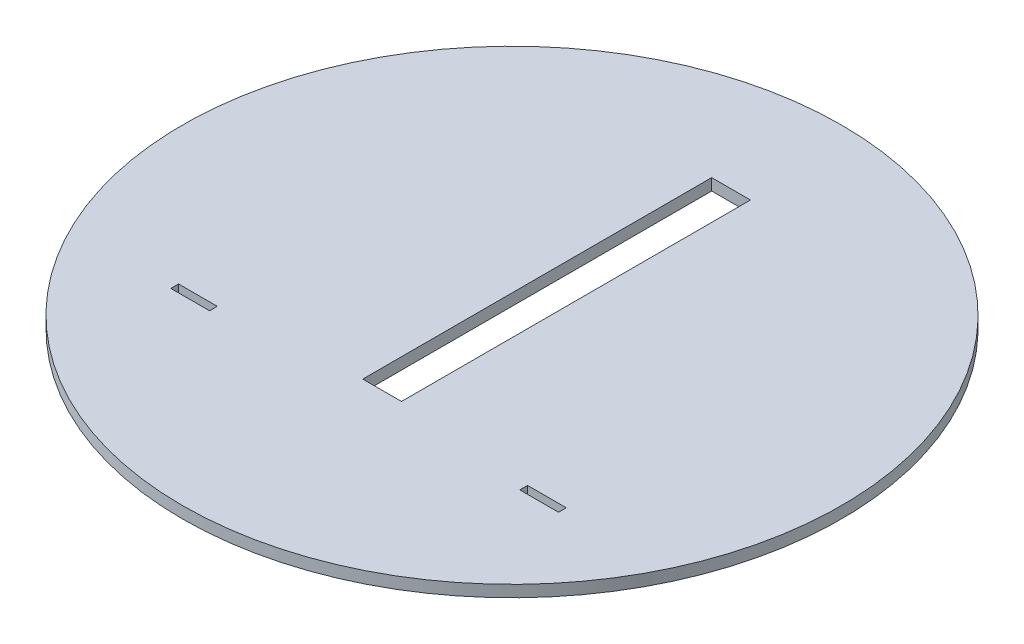
ISO-10303-21;
HEADER;
FILE_DESCRIPTION(('STEP AP214'),'2;1');
FILE_NAME('part.step','',(''),(''),'','','');
FILE_SCHEMA(('AUTOMOTIVE_DESIGN { 1 0 10303 214 1 1 1 1 }'));
ENDSEC;
DATA;
#1=APPLICATION_CONTEXT('core data for automotive mechanical design processes');
#2=APPLICATION_PROTOCOL_DEFINITION('international standard','automotive_design',2000,#1);
#3=PRODUCT_CONTEXT('',#1,'mechanical');
#4=PRODUCT('Part','Part','',(#3));
#5=PRODUCT_RELATED_PRODUCT_CATEGORY('part','',(#4));
#6=PRODUCT_DEFINITION_FORMATION('','',#4);
#7=PRODUCT_DEFINITION_CONTEXT('part definition',#1,'design');
#8=PRODUCT_DEFINITION('design','',#6,#7);
#9=PRODUCT_DEFINITION_SHAPE('','',#8);
#10=(LENGTH_UNIT() NAMED_UNIT(*) SI_UNIT(.MILLI.,.METRE.));
#11=(NAMED_UNIT(*) PLANE_ANGLE_UNIT() SI_UNIT($,.RADIAN.));
#12=(NAMED_UNIT(*) SI_UNIT($,.STERADIAN.) SOLID_ANGLE_UNIT());
#13=UNCERTAINTY_MEASURE_WITH_UNIT(LENGTH_MEASURE(1.E-05),#10,'distance_accuracy_value','');
#14=(GEOMETRIC_REPRESENTATION_CONTEXT(3) GLOBAL_UNCERTAINTY_ASSIGNED_CONTEXT((#13)) GLOBAL_UNIT_ASSIGNED_CONTEXT((#10,
#11,#12)) REPRESENTATION_CONTEXT('',''));
#15=CARTESIAN_POINT('',(0.,0.,0.));
#16=DIRECTION('',(0.,0.,1.));
#17=DIRECTION('',(1.,0.,0.));
#18=AXIS2_PLACEMENT_3D('',#15,#16,#17);
#19=CARTESIAN_POINT('',(0.,0.15,0.));
#20=DIRECTION('',(0.,-1.,0.));
#21=DIRECTION('',(0.,0.,-1.));
#22=AXIS2_PLACEMENT_3D('',#19,#20,#21);
#23=CYLINDRICAL_SURFACE('',#22,8.5);
#24=CARTESIAN_POINT('',(0.,0.15,0.));
#25=DIRECTION('',(0.,1.,0.));
#26=DIRECTION('',(0.,0.,1.));
#27=AXIS2_PLACEMENT_3D('',#24,#25,#26);
#28=CIRCLE('',#27,8.5);
#29=CARTESIAN_POINT('',(0.,0.15,8.5));
#30=VERTEX_POINT('',#29);
#31=EDGE_CURVE('E11',#30,#30,#28,.T.);
#32=ORIENTED_EDGE('',*,*,#31,.F.);
#33=EDGE_LOOP('',(#32));
#34=FACE_BOUND('',#33,.T.);
#35=CARTESIAN_POINT('',(0.,-0.15,0.));
#36=DIRECTION('',(0.,1.,0.));
#37=DIRECTION('',(0.,0.,1.));
#38=AXIS2_PLACEMENT_3D('',#35,#36,#37);
#39=CIRCLE('',#38,8.5);
#40=CARTESIAN_POINT('',(0.,-0.15,8.5));
#41=VERTEX_POINT('',#40);
#42=EDGE_CURVE('E37',#41,#41,#39,.T.);
#43=ORIENTED_EDGE('',*,*,#42,.T.);
#44=EDGE_LOOP('',(#43));
#45=FACE_BOUND('',#44,.T.);
#46=ADVANCED_FACE('F34',(#34,#45),#23,.T.);
#47=CARTESIAN_POINT('',(0.,0.15,0.));
#48=DIRECTION('',(0.,1.,0.));
#49=DIRECTION('',(0.,0.,1.));
#50=AXIS2_PLACEMENT_3D('',#47,#48,#49);
#51=PLANE('',#50);
#52=DIRECTION('',(0.,0.,-1.));
#53=VECTOR('',#52,1.);
#54=CARTESIAN_POINT('',(-4.,0.15,3.8));
#55=LINE('',#54,#53);
#56=CARTESIAN_POINT('',(-4.,0.15,3.8));
#57=VERTEX_POINT('',#56);
#58=CARTESIAN_POINT('',(-4.,0.15,3.6));
#59=VERTEX_POINT('',#58);
#60=EDGE_CURVE('E48',#57,#59,#55,.T.);
#61=ORIENTED_EDGE('',*,*,#60,.F.);
#62=DIRECTION('',(1.,0.,0.));
#63=VECTOR('',#62,1.);
#64=CARTESIAN_POINT('',(-4.,0.15,3.8));
#65=LINE('',#64,#63);
#66=CARTESIAN_POINT('',(-5.,0.15,3.8));
#67=VERTEX_POINT('',#66);
#68=EDGE_CURVE('E130',#67,#57,#65,.T.);
#69=ORIENTED_EDGE('',*,*,#68,.F.);
#70=DIRECTION('',(0.,0.,1.));
#71=VECTOR('',#70,1.);
#72=CARTESIAN_POINT('',(-5.,0.15,3.8));
#73=LINE('',#72,#71);
#74=CARTESIAN_POINT('',(-5.,0.15,3.6));
#75=VERTEX_POINT('',#74);
#76=EDGE_CURVE('E150',#75,#67,#73,.T.);
#77=ORIENTED_EDGE('',*,*,#76,.F.);
#78=DIRECTION('',(-1.,0.,0.));
#79=VECTOR('',#78,1.);
#80=CARTESIAN_POINT('',(-4.,0.15,3.6));
#81=LINE('',#80,#79);
#82=EDGE_CURVE('E144',#59,#75,#81,.T.);
#83=ORIENTED_EDGE('',*,*,#82,.F.);
#84=EDGE_LOOP('',(#61,#69,#77,#83));
#85=FACE_BOUND('',#84,.T.);
#86=DIRECTION('',(0.,0.,-1.));
#87=VECTOR('',#86,1.);
#88=CARTESIAN_POINT('',(5.,0.15,3.8));
#89=LINE('',#88,#87);
#90=CARTESIAN_POINT('',(5.,0.15,3.8));
#91=VERTEX_POINT('',#90);
#92=CARTESIAN_POINT('',(5.,0.15,3.6));
#93=VERTEX_POINT('',#92);
#94=EDGE_CURVE('E166',#91,#93,#89,.T.);
#95=ORIENTED_EDGE('',*,*,#94,.F.);
#96=DIRECTION('',(1.,0.,0.));
#97=VECTOR('',#96,1.);
#98=CARTESIAN_POINT('',(5.,0.15,3.8));
#99=LINE('',#98,#97);
#100=CARTESIAN_POINT('',(4.,0.15,3.8));
#101=VERTEX_POINT('',#100);
#102=EDGE_CURVE('E174',#101,#91,#99,.T.);
#103=ORIENTED_EDGE('',*,*,#102,.F.);
#104=DIRECTION('',(0.,0.,1.));
#105=VECTOR('',#104,1.);
#106=CARTESIAN_POINT('',(4.,0.15,3.8));
#107=LINE('',#106,#105);
#108=CARTESIAN_POINT('',(4.,0.15,3.6));
#109=VERTEX_POINT('',#108);
#110=EDGE_CURVE('E171',#109,#101,#107,.T.);
#111=ORIENTED_EDGE('',*,*,#110,.F.);
#112=DIRECTION('',(-1.,0.,0.));
#113=VECTOR('',#112,1.);
#114=CARTESIAN_POINT('',(5.,0.15,3.6));
#115=LINE('',#114,#113);
#116=EDGE_CURVE('E168',#93,#109,#115,.T.);
#117=ORIENTED_EDGE('',*,*,#116,.F.);
#118=EDGE_LOOP('',(#95,#103,#111,#117));
#119=FACE_BOUND('',#118,.T.);
#120=DIRECTION('',(0.,0.,1.));
#121=VECTOR('',#120,1.);
#122=CARTESIAN_POINT('',(-0.5,0.15,3.35));
#123=LINE('',#122,#121);
#124=CARTESIAN_POINT('',(-0.5,0.15,-5.65));
#125=VERTEX_POINT('',#124);
#126=CARTESIAN_POINT('',(-0.5,0.15,3.35));
#127=VERTEX_POINT('',#126);
#128=EDGE_CURVE('E197',#125,#127,#123,.T.);
#129=ORIENTED_EDGE('',*,*,#128,.F.);
#130=DIRECTION('',(-1.,0.,0.));
#131=VECTOR('',#130,1.);
#132=CARTESIAN_POINT('',(0.5,0.15,-5.65));
#133=LINE('',#132,#131);
#134=CARTESIAN_POINT('',(0.5,0.15,-5.65));
#135=VERTEX_POINT('',#134);
#136=EDGE_CURVE('E205',#135,#125,#133,.T.);
#137=ORIENTED_EDGE('',*,*,#136,.F.);
#138=DIRECTION('',(0.,0.,-1.));
#139=VECTOR('',#138,1.);
#140=CARTESIAN_POINT('',(0.5,0.15,3.35));
#141=LINE('',#140,#139);
#142=CARTESIAN_POINT('',(0.5,0.15,3.35));
#143=VERTEX_POINT('',#142);
#144=EDGE_CURVE('E202',#143,#135,#141,.T.);
#145=ORIENTED_EDGE('',*,*,#144,.F.);
#146=DIRECTION('',(1.,0.,0.));
#147=VECTOR('',#146,1.);
#148=CARTESIAN_POINT('',(0.5,0.15,3.35));
#149=LINE('',#148,#147);
#150=EDGE_CURVE('E199',#127,#143,#149,.T.);
#151=ORIENTED_EDGE('',*,*,#150,.F.);
#152=EDGE_LOOP('',(#129,#137,#145,#151));
#153=FACE_BOUND('',#152,.T.);
#154=ORIENTED_EDGE('',*,*,#31,.T.);
#155=EDGE_LOOP('',(#154));
#156=FACE_BOUND('',#155,.T.);
#157=ADVANCED_FACE('F229',(#85,#119,#153,#156),#51,.T.);
#158=CARTESIAN_POINT('',(0.,-0.15,0.));
#159=DIRECTION('',(0.,1.,0.));
#160=DIRECTION('',(0.,0.,1.));
#161=AXIS2_PLACEMENT_3D('',#158,#159,#160);
#162=PLANE('',#161);
#163=DIRECTION('',(-1.,0.,0.));
#164=VECTOR('',#163,1.);
#165=CARTESIAN_POINT('',(-4.,-0.15,3.8));
#166=LINE('',#165,#164);
#167=CARTESIAN_POINT('',(-4.,-0.15,3.8));
#168=VERTEX_POINT('',#167);
#169=CARTESIAN_POINT('',(-5.,-0.15,3.8));
#170=VERTEX_POINT('',#169);
#171=EDGE_CURVE('E142',#168,#170,#166,.T.);
#172=ORIENTED_EDGE('',*,*,#171,.F.);
#173=DIRECTION('',(0.,0.,1.));
#174=VECTOR('',#173,1.);
#175=CARTESIAN_POINT('',(-4.,-0.15,3.8));
#176=LINE('',#175,#174);
#177=CARTESIAN_POINT('',(-4.,-0.15,3.6));
#178=VERTEX_POINT('',#177);
#179=EDGE_CURVE('E124',#178,#168,#176,.T.);
#180=ORIENTED_EDGE('',*,*,#179,.F.);
#181=DIRECTION('',(1.,0.,0.));
#182=VECTOR('',#181,1.);
#183=CARTESIAN_POINT('',(-4.,-0.15,3.6));
#184=LINE('',#183,#182);
#185=CARTESIAN_POINT('',(-5.,-0.15,3.6));
#186=VERTEX_POINT('',#185);
#187=EDGE_CURVE('E133',#186,#178,#184,.T.);
#188=ORIENTED_EDGE('',*,*,#187,.F.);
#189=DIRECTION('',(0.,0.,-1.));
#190=VECTOR('',#189,1.);
#191=CARTESIAN_POINT('',(-5.,-0.15,3.8));
#192=LINE('',#191,#190);
#193=EDGE_CURVE('E56',#170,#186,#192,.T.);
#194=ORIENTED_EDGE('',*,*,#193,.F.);
#195=EDGE_LOOP('',(#172,#180,#188,#194));
#196=FACE_BOUND('',#195,.T.);
#197=DIRECTION('',(-1.,0.,0.));
#198=VECTOR('',#197,1.);
#199=CARTESIAN_POINT('',(5.,-0.15,3.8));
#200=LINE('',#199,#198);
#201=CARTESIAN_POINT('',(5.,-0.15,3.8));
#202=VERTEX_POINT('',#201);
#203=CARTESIAN_POINT('',(4.,-0.15,3.8));
#204=VERTEX_POINT('',#203);
#205=EDGE_CURVE('E160',#202,#204,#200,.T.);
#206=ORIENTED_EDGE('',*,*,#205,.F.);
#207=DIRECTION('',(0.,0.,1.));
#208=VECTOR('',#207,1.);
#209=CARTESIAN_POINT('',(5.,-0.15,3.8));
#210=LINE('',#209,#208);
#211=CARTESIAN_POINT('',(5.,-0.15,3.6));
#212=VERTEX_POINT('',#211);
#213=EDGE_CURVE('E163',#212,#202,#210,.T.);
#214=ORIENTED_EDGE('',*,*,#213,.F.);
#215=DIRECTION('',(1.,0.,0.));
#216=VECTOR('',#215,1.);
#217=CARTESIAN_POINT('',(5.,-0.15,3.6));
#218=LINE('',#217,#216);
#219=CARTESIAN_POINT('',(4.,-0.15,3.6));
#220=VERTEX_POINT('',#219);
#221=EDGE_CURVE('E180',#220,#212,#218,.T.);
#222=ORIENTED_EDGE('',*,*,#221,.F.);
#223=DIRECTION('',(0.,0.,-1.));
#224=VECTOR('',#223,1.);
#225=CARTESIAN_POINT('',(4.,-0.15,3.8));
#226=LINE('',#225,#224);
#227=EDGE_CURVE('E136',#204,#220,#226,.T.);
#228=ORIENTED_EDGE('',*,*,#227,.F.);
#229=EDGE_LOOP('',(#206,#214,#222,#228));
#230=FACE_BOUND('',#229,.T.);
#231=DIRECTION('',(1.,0.,0.));
#232=VECTOR('',#231,1.);
#233=CARTESIAN_POINT('',(0.5,-0.15,-5.65));
#234=LINE('',#233,#232);
#235=CARTESIAN_POINT('',(-0.5,-0.15,-5.65));
#236=VERTEX_POINT('',#235);
#237=CARTESIAN_POINT('',(0.5,-0.15,-5.65));
#238=VERTEX_POINT('',#237);
#239=EDGE_CURVE('E191',#236,#238,#234,.T.);
#240=ORIENTED_EDGE('',*,*,#239,.F.);
#241=DIRECTION('',(0.,0.,-1.));
#242=VECTOR('',#241,1.);
#243=CARTESIAN_POINT('',(-0.5,-0.15,3.35));
#244=LINE('',#243,#242);
#245=CARTESIAN_POINT('',(-0.5,-0.15,3.35));
#246=VERTEX_POINT('',#245);
#247=EDGE_CURVE('E194',#246,#236,#244,.T.);
#248=ORIENTED_EDGE('',*,*,#247,.F.);
#249=DIRECTION('',(-1.,0.,0.));
#250=VECTOR('',#249,1.);
#251=CARTESIAN_POINT('',(0.5,-0.15,3.35));
#252=LINE('',#251,#250);
#253=CARTESIAN_POINT('',(0.5,-0.15,3.35));
#254=VERTEX_POINT('',#253);
#255=EDGE_CURVE('E211',#254,#246,#252,.T.);
#256=ORIENTED_EDGE('',*,*,#255,.F.);
#257=DIRECTION('',(0.,0.,1.));
#258=VECTOR('',#257,1.);
#259=CARTESIAN_POINT('',(0.5,-0.15,3.35));
#260=LINE('',#259,#258);
#261=EDGE_CURVE('E189',#238,#254,#260,.T.);
#262=ORIENTED_EDGE('',*,*,#261,.F.);
#263=EDGE_LOOP('',(#240,#248,#256,#262));
#264=FACE_BOUND('',#263,.T.);
#265=ORIENTED_EDGE('',*,*,#42,.F.);
#266=EDGE_LOOP('',(#265));
#267=FACE_BOUND('',#266,.T.);
#268=ADVANCED_FACE('F139',(#196,#230,#264,#267),#162,.F.);
#269=CARTESIAN_POINT('',(-0.5,-0.151,3.35));
#270=DIRECTION('',(-1.,0.,0.));
#271=DIRECTION('',(0.,0.,1.));
#272=AXIS2_PLACEMENT_3D('',#269,#270,#271);
#273=PLANE('',#272);
#274=ORIENTED_EDGE('',*,*,#247,.T.);
#275=DIRECTION('',(0.,1.,0.));
#276=VECTOR('',#275,1.);
#277=CARTESIAN_POINT('',(-0.5,-0.151,-5.65));
#278=LINE('',#277,#276);
#279=EDGE_CURVE('E209',#236,#125,#278,.T.);
#280=ORIENTED_EDGE('',*,*,#279,.T.);
#281=ORIENTED_EDGE('',*,*,#128,.T.);
#282=DIRECTION('',(0.,1.,0.));
#283=VECTOR('',#282,1.);
#284=CARTESIAN_POINT('',(-0.5,-0.151,3.35));
#285=LINE('',#284,#283);
#286=EDGE_CURVE('E208',#246,#127,#285,.T.);
#287=ORIENTED_EDGE('',*,*,#286,.F.);
#288=EDGE_LOOP('',(#274,#280,#281,#287));
#289=FACE_BOUND('',#288,.T.);
#290=ADVANCED_FACE('F228',(#289),#273,.F.);
#291=CARTESIAN_POINT('',(0.5,-0.151,-5.65));
#292=DIRECTION('',(0.,0.,-1.));
#293=DIRECTION('',(-1.,0.,0.));
#294=AXIS2_PLACEMENT_3D('',#291,#292,#293);
#295=PLANE('',#294);
#296=ORIENTED_EDGE('',*,*,#239,.T.);
#297=DIRECTION('',(0.,1.,0.));
#298=VECTOR('',#297,1.);
#299=CARTESIAN_POINT('',(0.5,-0.151,-5.65));
#300=LINE('',#299,#298);
#301=EDGE_CURVE('E212',#238,#135,#300,.T.);
#302=ORIENTED_EDGE('',*,*,#301,.T.);
#303=ORIENTED_EDGE('',*,*,#136,.T.);
#304=ORIENTED_EDGE('',*,*,#279,.F.);
#305=EDGE_LOOP('',(#296,#302,#303,#304));
#306=FACE_BOUND('',#305,.T.);
#307=ADVANCED_FACE('F234',(#306),#295,.F.);
#308=CARTESIAN_POINT('',(0.5,-0.151,3.35));
#309=DIRECTION('',(1.,0.,0.));
#310=DIRECTION('',(0.,0.,-1.));
#311=AXIS2_PLACEMENT_3D('',#308,#309,#310);
#312=PLANE('',#311);
#313=ORIENTED_EDGE('',*,*,#261,.T.);
#314=DIRECTION('',(0.,1.,0.));
#315=VECTOR('',#314,1.);
#316=CARTESIAN_POINT('',(0.5,-0.151,3.35));
#317=LINE('',#316,#315);
#318=EDGE_CURVE('E214',#254,#143,#317,.T.);
#319=ORIENTED_EDGE('',*,*,#318,.T.);
#320=ORIENTED_EDGE('',*,*,#144,.T.);
#321=ORIENTED_EDGE('',*,*,#301,.F.);
#322=EDGE_LOOP('',(#313,#319,#320,#321));
#323=FACE_BOUND('',#322,.T.);
#324=ADVANCED_FACE('F268',(#323),#312,.F.);
#325=CARTESIAN_POINT('',(0.5,-0.151,3.35));
#326=DIRECTION('',(0.,0.,1.));
#327=DIRECTION('',(1.,0.,0.));
#328=AXIS2_PLACEMENT_3D('',#325,#326,#327);
#329=PLANE('',#328);
#330=ORIENTED_EDGE('',*,*,#255,.T.);
#331=ORIENTED_EDGE('',*,*,#286,.T.);
#332=ORIENTED_EDGE('',*,*,#150,.T.);
#333=ORIENTED_EDGE('',*,*,#318,.F.);
#334=EDGE_LOOP('',(#330,#331,#332,#333));
#335=FACE_BOUND('',#334,.T.);
#336=ADVANCED_FACE('F278',(#335),#329,.F.);
#337=CARTESIAN_POINT('',(5.,-0.151,3.8));
#338=DIRECTION('',(1.,0.,0.));
#339=DIRECTION('',(0.,0.,-1.));
#340=AXIS2_PLACEMENT_3D('',#337,#338,#339);
#341=PLANE('',#340);
#342=ORIENTED_EDGE('',*,*,#213,.T.);
#343=DIRECTION('',(0.,1.,0.));
#344=VECTOR('',#343,1.);
#345=CARTESIAN_POINT('',(5.,-0.151,3.8));
#346=LINE('',#345,#344);
#347=EDGE_CURVE('E178',#202,#91,#346,.T.);
#348=ORIENTED_EDGE('',*,*,#347,.T.);
#349=ORIENTED_EDGE('',*,*,#94,.T.);
#350=DIRECTION('',(0.,1.,0.));
#351=VECTOR('',#350,1.);
#352=CARTESIAN_POINT('',(5.,-0.151,3.6));
#353=LINE('',#352,#351);
#354=EDGE_CURVE('E177',#212,#93,#353,.T.);
#355=ORIENTED_EDGE('',*,*,#354,.F.);
#356=EDGE_LOOP('',(#342,#348,#349,#355));
#357=FACE_BOUND('',#356,.T.);
#358=ADVANCED_FACE('F288',(#357),#341,.F.);
#359=CARTESIAN_POINT('',(5.,-0.151,3.8));
#360=DIRECTION('',(0.,0.,1.));
#361=DIRECTION('',(1.,0.,0.));
#362=AXIS2_PLACEMENT_3D('',#359,#360,#361);
#363=PLANE('',#362);
#364=ORIENTED_EDGE('',*,*,#205,.T.);
#365=DIRECTION('',(0.,1.,0.));
#366=VECTOR('',#365,1.);
#367=CARTESIAN_POINT('',(4.,-0.151,3.8));
#368=LINE('',#367,#366);
#369=EDGE_CURVE('E181',#204,#101,#368,.T.);
#370=ORIENTED_EDGE('',*,*,#369,.T.);
#371=ORIENTED_EDGE('',*,*,#102,.T.);
#372=ORIENTED_EDGE('',*,*,#347,.F.);
#373=EDGE_LOOP('',(#364,#370,#371,#372));
#374=FACE_BOUND('',#373,.T.);
#375=ADVANCED_FACE('F297',(#374),#363,.F.);
#376=CARTESIAN_POINT('',(4.,-0.151,3.8));
#377=DIRECTION('',(-1.,0.,0.));
#378=DIRECTION('',(0.,0.,1.));
#379=AXIS2_PLACEMENT_3D('',#376,#377,#378);
#380=PLANE('',#379);
#381=ORIENTED_EDGE('',*,*,#227,.T.);
#382=DIRECTION('',(0.,1.,0.));
#383=VECTOR('',#382,1.);
#384=CARTESIAN_POINT('',(4.,-0.151,3.6));
#385=LINE('',#384,#383);
#386=EDGE_CURVE('E183',#220,#109,#385,.T.);
#387=ORIENTED_EDGE('',*,*,#386,.T.);
#388=ORIENTED_EDGE('',*,*,#110,.T.);
#389=ORIENTED_EDGE('',*,*,#369,.F.);
#390=EDGE_LOOP('',(#381,#387,#388,#389));
#391=FACE_BOUND('',#390,.T.);
#392=ADVANCED_FACE('F307',(#391),#380,.F.);
#393=CARTESIAN_POINT('',(5.,-0.151,3.6));
#394=DIRECTION('',(0.,0.,-1.));
#395=DIRECTION('',(-1.,0.,0.));
#396=AXIS2_PLACEMENT_3D('',#393,#394,#395);
#397=PLANE('',#396);
#398=ORIENTED_EDGE('',*,*,#221,.T.);
#399=ORIENTED_EDGE('',*,*,#354,.T.);
#400=ORIENTED_EDGE('',*,*,#116,.T.);
#401=ORIENTED_EDGE('',*,*,#386,.F.);
#402=EDGE_LOOP('',(#398,#399,#400,#401));
#403=FACE_BOUND('',#402,.T.);
#404=ADVANCED_FACE('F317',(#403),#397,.F.);
#405=CARTESIAN_POINT('',(-4.,-0.151,3.8));
#406=DIRECTION('',(1.,0.,0.));
#407=DIRECTION('',(0.,0.,-1.));
#408=AXIS2_PLACEMENT_3D('',#405,#406,#407);
#409=PLANE('',#408);
#410=ORIENTED_EDGE('',*,*,#179,.T.);
#411=DIRECTION('',(0.,1.,0.));
#412=VECTOR('',#411,1.);
#413=CARTESIAN_POINT('',(-4.,-0.151,3.8));
#414=LINE('',#413,#412);
#415=EDGE_CURVE('E137',#168,#57,#414,.T.);
#416=ORIENTED_EDGE('',*,*,#415,.T.);
#417=ORIENTED_EDGE('',*,*,#60,.T.);
#418=DIRECTION('',(0.,1.,0.));
#419=VECTOR('',#418,1.);
#420=CARTESIAN_POINT('',(-4.,-0.151,3.6));
#421=LINE('',#420,#419);
#422=EDGE_CURVE('E120',#178,#59,#421,.T.);
#423=ORIENTED_EDGE('',*,*,#422,.F.);
#424=EDGE_LOOP('',(#410,#416,#417,#423));
#425=FACE_BOUND('',#424,.T.);
#426=ADVANCED_FACE('F122',(#425),#409,.F.);
#427=CARTESIAN_POINT('',(-4.,-0.151,3.8));
#428=DIRECTION('',(0.,0.,1.));
#429=DIRECTION('',(1.,0.,0.));
#430=AXIS2_PLACEMENT_3D('',#427,#428,#429);
#431=PLANE('',#430);
#432=ORIENTED_EDGE('',*,*,#171,.T.);
#433=DIRECTION('',(0.,1.,0.));
#434=VECTOR('',#433,1.);
#435=CARTESIAN_POINT('',(-5.,-0.151,3.8));
#436=LINE('',#435,#434);
#437=EDGE_CURVE('E156',#170,#67,#436,.T.);
#438=ORIENTED_EDGE('',*,*,#437,.T.);
#439=ORIENTED_EDGE('',*,*,#68,.T.);
#440=ORIENTED_EDGE('',*,*,#415,.F.);
#441=EDGE_LOOP('',(#432,#438,#439,#440));
#442=FACE_BOUND('',#441,.T.);
#443=ADVANCED_FACE('F336',(#442),#431,.F.);
#444=CARTESIAN_POINT('',(-5.,-0.151,3.8));
#445=DIRECTION('',(-1.,0.,0.));
#446=DIRECTION('',(0.,0.,1.));
#447=AXIS2_PLACEMENT_3D('',#444,#445,#446);
#448=PLANE('',#447);
#449=ORIENTED_EDGE('',*,*,#193,.T.);
#450=DIRECTION('',(0.,1.,0.));
#451=VECTOR('',#450,1.);
#452=CARTESIAN_POINT('',(-5.,-0.151,3.6));
#453=LINE('',#452,#451);
#454=EDGE_CURVE('E129',#186,#75,#453,.T.);
#455=ORIENTED_EDGE('',*,*,#454,.T.);
#456=ORIENTED_EDGE('',*,*,#76,.T.);
#457=ORIENTED_EDGE('',*,*,#437,.F.);
#458=EDGE_LOOP('',(#449,#455,#456,#457));
#459=FACE_BOUND('',#458,.T.);
#460=ADVANCED_FACE('F345',(#459),#448,.F.);
#461=CARTESIAN_POINT('',(-4.,-0.151,3.6));
#462=DIRECTION('',(0.,0.,-1.));
#463=DIRECTION('',(-1.,0.,0.));
#464=AXIS2_PLACEMENT_3D('',#461,#462,#463);
#465=PLANE('',#464);
#466=ORIENTED_EDGE('',*,*,#187,.T.);
#467=ORIENTED_EDGE('',*,*,#422,.T.);
#468=ORIENTED_EDGE('',*,*,#82,.T.);
#469=ORIENTED_EDGE('',*,*,#454,.F.);
#470=EDGE_LOOP('',(#466,#467,#468,#469));
#471=FACE_BOUND('',#470,.T.);
#472=ADVANCED_FACE('F134',(#471),#465,.F.);
#473=CLOSED_SHELL('',(#46,#157,#268,#290,#307,#324,#336,#358,#375,#392,#404,#426,#443,#460,#472));
#474=MANIFOLD_SOLID_BREP('B2',#473);
#475=ADVANCED_BREP_SHAPE_REPRESENTATION('',(#18,#474),#14);
#476=SHAPE_DEFINITION_REPRESENTATION(#9,#475);
ENDSEC;
END-ISO-10303-21;
